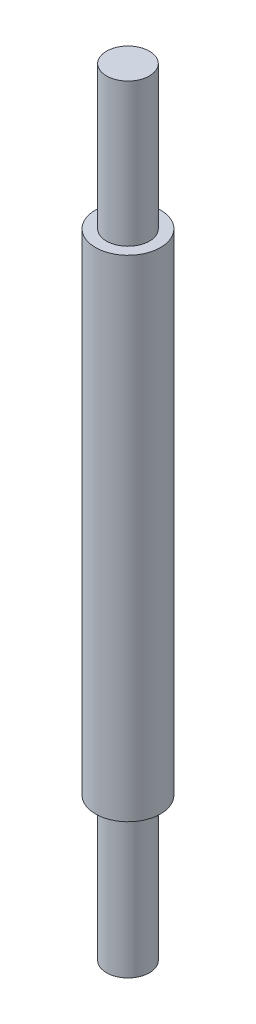
ISO-10303-21;
HEADER;
FILE_DESCRIPTION(('STEP AP214'),'2;1');
FILE_NAME('part.step','',(''),(''),'','','');
FILE_SCHEMA(('AUTOMOTIVE_DESIGN { 1 0 10303 214 1 1 1 1 }'));
ENDSEC;
DATA;
#1=APPLICATION_CONTEXT('core data for automotive mechanical design processes');
#2=APPLICATION_PROTOCOL_DEFINITION('international standard','automotive_design',2000,#1);
#3=PRODUCT_CONTEXT('',#1,'mechanical');
#4=PRODUCT('Part','Part','',(#3));
#5=PRODUCT_RELATED_PRODUCT_CATEGORY('part','',(#4));
#6=PRODUCT_DEFINITION_FORMATION('','',#4);
#7=PRODUCT_DEFINITION_CONTEXT('part definition',#1,'design');
#8=PRODUCT_DEFINITION('design','',#6,#7);
#9=PRODUCT_DEFINITION_SHAPE('','',#8);
#10=(LENGTH_UNIT() NAMED_UNIT(*) SI_UNIT(.MILLI.,.METRE.));
#11=(NAMED_UNIT(*) PLANE_ANGLE_UNIT() SI_UNIT($,.RADIAN.));
#12=(NAMED_UNIT(*) SI_UNIT($,.STERADIAN.) SOLID_ANGLE_UNIT());
#13=UNCERTAINTY_MEASURE_WITH_UNIT(LENGTH_MEASURE(1.E-05),#10,'distance_accuracy_value','');
#14=(GEOMETRIC_REPRESENTATION_CONTEXT(3) GLOBAL_UNCERTAINTY_ASSIGNED_CONTEXT((#13)) GLOBAL_UNIT_ASSIGNED_CONTEXT((#10,
#11,#12)) REPRESENTATION_CONTEXT('',''));
#15=CARTESIAN_POINT('',(0.,0.,0.));
#16=DIRECTION('',(0.,0.,1.));
#17=DIRECTION('',(1.,0.,0.));
#18=AXIS2_PLACEMENT_3D('',#15,#16,#17);
#19=CARTESIAN_POINT('',(0.,60.96,0.));
#20=DIRECTION('',(0.,-1.,0.));
#21=DIRECTION('',(0.,0.,-1.));
#22=AXIS2_PLACEMENT_3D('',#19,#20,#21);
#23=CYLINDRICAL_SURFACE('',#22,4.039553008);
#24=CARTESIAN_POINT('',(0.,60.96,0.));
#25=DIRECTION('',(0.,1.,0.));
#26=DIRECTION('',(0.,0.,1.));
#27=AXIS2_PLACEMENT_3D('',#24,#25,#26);
#28=CIRCLE('',#27,4.039553008);
#29=CARTESIAN_POINT('',(0.,60.96,4.039553008));
#30=VERTEX_POINT('',#29);
#31=EDGE_CURVE('E44',#30,#30,#28,.T.);
#32=ORIENTED_EDGE('',*,*,#31,.F.);
#33=EDGE_LOOP('',(#32));
#34=FACE_BOUND('',#33,.T.);
#35=CARTESIAN_POINT('',(0.,0.,0.));
#36=DIRECTION('',(0.,1.,0.));
#37=DIRECTION('',(0.,0.,1.));
#38=AXIS2_PLACEMENT_3D('',#35,#36,#37);
#39=CIRCLE('',#38,4.039553008);
#40=CARTESIAN_POINT('',(0.,0.,4.039553008));
#41=VERTEX_POINT('',#40);
#42=EDGE_CURVE('E35',#41,#41,#39,.T.);
#43=ORIENTED_EDGE('',*,*,#42,.T.);
#44=EDGE_LOOP('',(#43));
#45=FACE_BOUND('',#44,.T.);
#46=ADVANCED_FACE('F32',(#34,#45),#23,.T.);
#47=CARTESIAN_POINT('',(0.,60.96,0.));
#48=DIRECTION('',(0.,1.,0.));
#49=DIRECTION('',(0.,0.,1.));
#50=AXIS2_PLACEMENT_3D('',#47,#48,#49);
#51=PLANE('',#50);
#52=CARTESIAN_POINT('',(0.,60.96,0.));
#53=DIRECTION('',(0.,1.,0.));
#54=DIRECTION('',(0.,0.,1.));
#55=AXIS2_PLACEMENT_3D('',#52,#53,#54);
#56=CIRCLE('',#55,2.667);
#57=CARTESIAN_POINT('',(0.,60.96,2.667));
#58=VERTEX_POINT('',#57);
#59=EDGE_CURVE('E39',#58,#58,#56,.T.);
#60=ORIENTED_EDGE('',*,*,#59,.F.);
#61=EDGE_LOOP('',(#60));
#62=FACE_BOUND('',#61,.T.);
#63=ORIENTED_EDGE('',*,*,#31,.T.);
#64=EDGE_LOOP('',(#63));
#65=FACE_BOUND('',#64,.T.);
#66=ADVANCED_FACE('F61',(#62,#65),#51,.T.);
#67=CARTESIAN_POINT('',(0.,0.,0.));
#68=DIRECTION('',(0.,1.,0.));
#69=DIRECTION('',(0.,0.,1.));
#70=AXIS2_PLACEMENT_3D('',#67,#68,#69);
#71=PLANE('',#70);
#72=CARTESIAN_POINT('',(0.,0.,0.));
#73=DIRECTION('',(0.,-1.,0.));
#74=DIRECTION('',(0.,0.,-1.));
#75=AXIS2_PLACEMENT_3D('',#72,#73,#74);
#76=CIRCLE('',#75,2.667);
#77=CARTESIAN_POINT('',(0.,0.,-2.667));
#78=VERTEX_POINT('',#77);
#79=EDGE_CURVE('E10',#78,#78,#76,.T.);
#80=ORIENTED_EDGE('',*,*,#79,.F.);
#81=EDGE_LOOP('',(#80));
#82=FACE_BOUND('',#81,.T.);
#83=ORIENTED_EDGE('',*,*,#42,.F.);
#84=EDGE_LOOP('',(#83));
#85=FACE_BOUND('',#84,.T.);
#86=ADVANCED_FACE('F58',(#82,#85),#71,.F.);
#87=CARTESIAN_POINT('',(0.,78.74,0.));
#88=DIRECTION('',(0.,-1.,0.));
#89=DIRECTION('',(0.,0.,-1.));
#90=AXIS2_PLACEMENT_3D('',#87,#88,#89);
#91=CYLINDRICAL_SURFACE('',#90,2.667);
#92=CARTESIAN_POINT('',(0.,78.74,0.));
#93=DIRECTION('',(0.,1.,0.));
#94=DIRECTION('',(0.,0.,1.));
#95=AXIS2_PLACEMENT_3D('',#92,#93,#94);
#96=CIRCLE('',#95,2.667);
#97=CARTESIAN_POINT('',(0.,78.74,2.667));
#98=VERTEX_POINT('',#97);
#99=EDGE_CURVE('E49',#98,#98,#96,.T.);
#100=ORIENTED_EDGE('',*,*,#99,.F.);
#101=EDGE_LOOP('',(#100));
#102=FACE_BOUND('',#101,.T.);
#103=ORIENTED_EDGE('',*,*,#59,.T.);
#104=EDGE_LOOP('',(#103));
#105=FACE_BOUND('',#104,.T.);
#106=ADVANCED_FACE('F60',(#102,#105),#91,.T.);
#107=CARTESIAN_POINT('',(0.,78.74,0.));
#108=DIRECTION('',(0.,1.,0.));
#109=DIRECTION('',(0.,0.,1.));
#110=AXIS2_PLACEMENT_3D('',#107,#108,#109);
#111=PLANE('',#110);
#112=ORIENTED_EDGE('',*,*,#99,.T.);
#113=EDGE_LOOP('',(#112));
#114=FACE_BOUND('',#113,.T.);
#115=ADVANCED_FACE('F67',(#114),#111,.T.);
#116=CARTESIAN_POINT('',(0.,-17.78,0.));
#117=DIRECTION('',(0.,1.,0.));
#118=DIRECTION('',(0.,0.,1.));
#119=AXIS2_PLACEMENT_3D('',#116,#117,#118);
#120=CYLINDRICAL_SURFACE('',#119,2.667);
#121=CARTESIAN_POINT('',(0.,-17.78,0.));
#122=DIRECTION('',(0.,-1.,0.));
#123=DIRECTION('',(0.,0.,-1.));
#124=AXIS2_PLACEMENT_3D('',#121,#122,#123);
#125=CIRCLE('',#124,2.667);
#126=CARTESIAN_POINT('',(0.,-17.78,-2.667));
#127=VERTEX_POINT('',#126);
#128=EDGE_CURVE('E48',#127,#127,#125,.T.);
#129=ORIENTED_EDGE('',*,*,#128,.F.);
#130=EDGE_LOOP('',(#129));
#131=FACE_BOUND('',#130,.T.);
#132=ORIENTED_EDGE('',*,*,#79,.T.);
#133=EDGE_LOOP('',(#132));
#134=FACE_BOUND('',#133,.T.);
#135=ADVANCED_FACE('F97',(#131,#134),#120,.T.);
#136=CARTESIAN_POINT('',(0.,-17.78,0.));
#137=DIRECTION('',(0.,-1.,0.));
#138=DIRECTION('',(0.,0.,-1.));
#139=AXIS2_PLACEMENT_3D('',#136,#137,#138);
#140=PLANE('',#139);
#141=ORIENTED_EDGE('',*,*,#128,.T.);
#142=EDGE_LOOP('',(#141));
#143=FACE_BOUND('',#142,.T.);
#144=ADVANCED_FACE('F111',(#143),#140,.T.);
#145=CLOSED_SHELL('',(#46,#66,#86,#106,#115,#135,#144));
#146=MANIFOLD_SOLID_BREP('B2',#145);
#147=ADVANCED_BREP_SHAPE_REPRESENTATION('',(#18,#146),#14);
#148=SHAPE_DEFINITION_REPRESENTATION(#9,#147);
ENDSEC;
END-ISO-10303-21;
